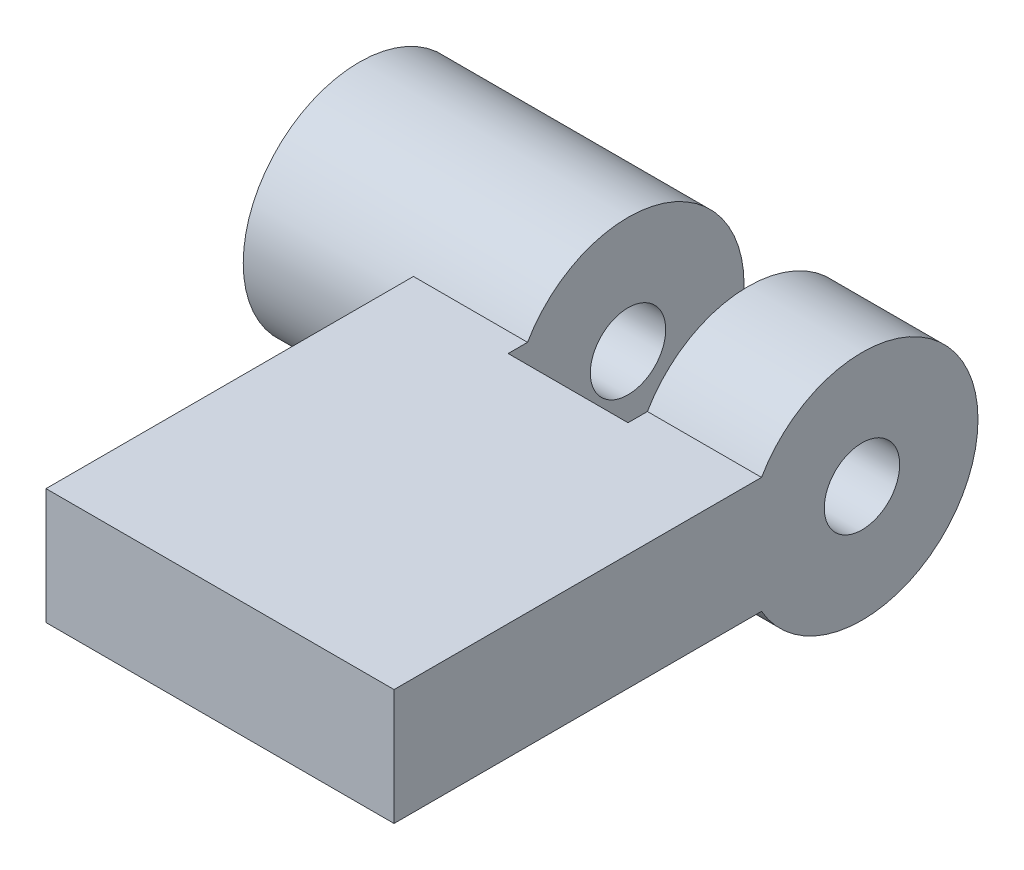
ISO-10303-21;
HEADER;
FILE_DESCRIPTION(('STEP AP214'),'2;1');
FILE_NAME('part.step','',(''),(''),'','','');
FILE_SCHEMA(('AUTOMOTIVE_DESIGN { 1 0 10303 214 1 1 1 1 }'));
ENDSEC;
DATA;
#1=APPLICATION_CONTEXT('core data for automotive mechanical design processes');
#2=APPLICATION_PROTOCOL_DEFINITION('international standard','automotive_design',2000,#1);
#3=PRODUCT_CONTEXT('',#1,'mechanical');
#4=PRODUCT('Part','Part','',(#3));
#5=PRODUCT_RELATED_PRODUCT_CATEGORY('part','',(#4));
#6=PRODUCT_DEFINITION_FORMATION('','',#4);
#7=PRODUCT_DEFINITION_CONTEXT('part definition',#1,'design');
#8=PRODUCT_DEFINITION('design','',#6,#7);
#9=PRODUCT_DEFINITION_SHAPE('','',#8);
#10=(LENGTH_UNIT() NAMED_UNIT(*) SI_UNIT(.MILLI.,.METRE.));
#11=(NAMED_UNIT(*) PLANE_ANGLE_UNIT() SI_UNIT($,.RADIAN.));
#12=(NAMED_UNIT(*) SI_UNIT($,.STERADIAN.) SOLID_ANGLE_UNIT());
#13=UNCERTAINTY_MEASURE_WITH_UNIT(LENGTH_MEASURE(1.E-05),#10,'distance_accuracy_value','');
#14=(GEOMETRIC_REPRESENTATION_CONTEXT(3) GLOBAL_UNCERTAINTY_ASSIGNED_CONTEXT((#13)) GLOBAL_UNIT_ASSIGNED_CONTEXT((#10,
#11,#12)) REPRESENTATION_CONTEXT('',''));
#15=CARTESIAN_POINT('',(0.,0.,0.));
#16=DIRECTION('',(0.,0.,1.));
#17=DIRECTION('',(1.,0.,0.));
#18=AXIS2_PLACEMENT_3D('',#15,#16,#17);
#19=CARTESIAN_POINT('',(0.,3.,-9.));
#20=DIRECTION('',(0.,0.,1.));
#21=DIRECTION('',(1.,0.,0.));
#22=AXIS2_PLACEMENT_3D('',#19,#20,#21);
#23=PLANE('',#22);
#24=DIRECTION('',(0.,-1.,0.));
#25=VECTOR('',#24,1.);
#26=CARTESIAN_POINT('',(2.95,4.5,-9.));
#27=LINE('',#26,#25);
#28=CARTESIAN_POINT('',(2.95000000000001,3.,-9.));
#29=VERTEX_POINT('',#28);
#30=CARTESIAN_POINT('',(2.95000000000001,0.,-9.));
#31=VERTEX_POINT('',#30);
#32=EDGE_CURVE('E360',#29,#31,#27,.T.);
#33=ORIENTED_EDGE('',*,*,#32,.F.);
#34=DIRECTION('',(-1.,0.,0.));
#35=VECTOR('',#34,1.);
#36=CARTESIAN_POINT('',(0.,3.,-9.));
#37=LINE('',#36,#35);
#38=CARTESIAN_POINT('',(6.05,3.,-9.));
#39=VERTEX_POINT('',#38);
#40=EDGE_CURVE('E378',#39,#29,#37,.T.);
#41=ORIENTED_EDGE('',*,*,#40,.F.);
#42=DIRECTION('',(0.,1.,0.));
#43=VECTOR('',#42,1.);
#44=CARTESIAN_POINT('',(6.05,4.5,-9.));
#45=LINE('',#44,#43);
#46=CARTESIAN_POINT('',(6.05,0.,-9.));
#47=VERTEX_POINT('',#46);
#48=EDGE_CURVE('E365',#47,#39,#45,.T.);
#49=ORIENTED_EDGE('',*,*,#48,.F.);
#50=DIRECTION('',(-1.,0.,0.));
#51=VECTOR('',#50,1.);
#52=CARTESIAN_POINT('',(0.,0.,-9.));
#53=LINE('',#52,#51);
#54=EDGE_CURVE('E374',#47,#31,#53,.T.);
#55=ORIENTED_EDGE('',*,*,#54,.T.);
#56=EDGE_LOOP('',(#33,#41,#49,#55));
#57=FACE_BOUND('',#56,.T.);
#58=ADVANCED_FACE('F40',(#57),#23,.F.);
#59=CARTESIAN_POINT('',(0.,3.,0.));
#60=DIRECTION('',(1.,0.,0.));
#61=DIRECTION('',(0.,0.,-1.));
#62=AXIS2_PLACEMENT_3D('',#59,#60,#61);
#63=PLANE('',#62);
#64=CARTESIAN_POINT('',(0.,1.5,-12.1));
#65=DIRECTION('',(-1.,0.,0.));
#66=DIRECTION('',(0.,0.,1.));
#67=AXIS2_PLACEMENT_3D('',#64,#65,#66);
#68=CIRCLE('',#67,3.);
#69=CARTESIAN_POINT('',(0.,0.,-9.50192378864669));
#70=VERTEX_POINT('',#69);
#71=CARTESIAN_POINT('',(0.,3.,-9.50192378864669));
#72=VERTEX_POINT('',#71);
#73=EDGE_CURVE('E53',#70,#72,#68,.T.);
#74=ORIENTED_EDGE('',*,*,#73,.F.);
#75=DIRECTION('',(0.,0.,1.));
#76=VECTOR('',#75,1.);
#77=CARTESIAN_POINT('',(0.,0.,0.));
#78=LINE('',#77,#76);
#79=CARTESIAN_POINT('',(0.,0.,0.));
#80=VERTEX_POINT('',#79);
#81=EDGE_CURVE('E363',#70,#80,#78,.T.);
#82=ORIENTED_EDGE('',*,*,#81,.T.);
#83=DIRECTION('',(0.,-1.,0.));
#84=VECTOR('',#83,1.);
#85=CARTESIAN_POINT('',(0.,3.,0.));
#86=LINE('',#85,#84);
#87=CARTESIAN_POINT('',(0.,3.,0.));
#88=VERTEX_POINT('',#87);
#89=EDGE_CURVE('E369',#88,#80,#86,.T.);
#90=ORIENTED_EDGE('',*,*,#89,.F.);
#91=DIRECTION('',(0.,0.,1.));
#92=VECTOR('',#91,1.);
#93=CARTESIAN_POINT('',(0.,3.,0.));
#94=LINE('',#93,#92);
#95=EDGE_CURVE('E370',#72,#88,#94,.T.);
#96=ORIENTED_EDGE('',*,*,#95,.F.);
#97=EDGE_LOOP('',(#74,#82,#90,#96));
#98=FACE_BOUND('',#97,.T.);
#99=ADVANCED_FACE('F439',(#98),#63,.F.);
#100=CARTESIAN_POINT('',(0.,3.,0.));
#101=DIRECTION('',(0.,0.,-1.));
#102=DIRECTION('',(-1.,0.,0.));
#103=AXIS2_PLACEMENT_3D('',#100,#101,#102);
#104=PLANE('',#103);
#105=DIRECTION('',(1.,0.,0.));
#106=VECTOR('',#105,1.);
#107=CARTESIAN_POINT('',(0.,0.,0.));
#108=LINE('',#107,#106);
#109=CARTESIAN_POINT('',(9.,0.,0.));
#110=VERTEX_POINT('',#109);
#111=EDGE_CURVE('E384',#80,#110,#108,.T.);
#112=ORIENTED_EDGE('',*,*,#111,.T.);
#113=DIRECTION('',(0.,-1.,0.));
#114=VECTOR('',#113,1.);
#115=CARTESIAN_POINT('',(9.,3.,0.));
#116=LINE('',#115,#114);
#117=CARTESIAN_POINT('',(9.,3.,0.));
#118=VERTEX_POINT('',#117);
#119=EDGE_CURVE('E381',#118,#110,#116,.T.);
#120=ORIENTED_EDGE('',*,*,#119,.F.);
#121=DIRECTION('',(1.,0.,0.));
#122=VECTOR('',#121,1.);
#123=CARTESIAN_POINT('',(0.,3.,0.));
#124=LINE('',#123,#122);
#125=EDGE_CURVE('E373',#88,#118,#124,.T.);
#126=ORIENTED_EDGE('',*,*,#125,.F.);
#127=ORIENTED_EDGE('',*,*,#89,.T.);
#128=EDGE_LOOP('',(#112,#120,#126,#127));
#129=FACE_BOUND('',#128,.T.);
#130=ADVANCED_FACE('F441',(#129),#104,.F.);
#131=CARTESIAN_POINT('',(9.,3.,0.));
#132=DIRECTION('',(-1.,0.,0.));
#133=DIRECTION('',(0.,0.,1.));
#134=AXIS2_PLACEMENT_3D('',#131,#132,#133);
#135=PLANE('',#134);
#136=CARTESIAN_POINT('',(9.,1.5,-12.1));
#137=DIRECTION('',(1.,0.,0.));
#138=DIRECTION('',(0.,0.,-1.));
#139=AXIS2_PLACEMENT_3D('',#136,#137,#138);
#140=CIRCLE('',#139,0.975);
#141=CARTESIAN_POINT('',(9.,1.5,-13.075));
#142=VERTEX_POINT('',#141);
#143=EDGE_CURVE('E349',#142,#142,#140,.T.);
#144=ORIENTED_EDGE('',*,*,#143,.F.);
#145=EDGE_LOOP('',(#144));
#146=FACE_BOUND('',#145,.T.);
#147=CARTESIAN_POINT('',(9.,1.5,-12.1));
#148=DIRECTION('',(-1.,0.,0.));
#149=DIRECTION('',(0.,0.,1.));
#150=AXIS2_PLACEMENT_3D('',#147,#148,#149);
#151=CIRCLE('',#150,3.);
#152=CARTESIAN_POINT('',(9.,1.5,-15.1));
#153=VERTEX_POINT('',#152);
#154=CARTESIAN_POINT('',(9.,3.,-9.50192378864669));
#155=VERTEX_POINT('',#154);
#156=EDGE_CURVE('E401',#153,#155,#151,.F.);
#157=ORIENTED_EDGE('',*,*,#156,.T.);
#158=DIRECTION('',(0.,0.,-1.));
#159=VECTOR('',#158,1.);
#160=CARTESIAN_POINT('',(9.,3.,0.));
#161=LINE('',#160,#159);
#162=EDGE_CURVE('E376',#118,#155,#161,.T.);
#163=ORIENTED_EDGE('',*,*,#162,.F.);
#164=ORIENTED_EDGE('',*,*,#119,.T.);
#165=DIRECTION('',(0.,0.,-1.));
#166=VECTOR('',#165,1.);
#167=CARTESIAN_POINT('',(9.,0.,0.));
#168=LINE('',#167,#166);
#169=CARTESIAN_POINT('',(9.,0.,-9.50192378864669));
#170=VERTEX_POINT('',#169);
#171=EDGE_CURVE('E386',#110,#170,#168,.T.);
#172=ORIENTED_EDGE('',*,*,#171,.T.);
#173=CARTESIAN_POINT('',(9.,1.5,-12.1));
#174=DIRECTION('',(-1.,0.,0.));
#175=DIRECTION('',(0.,0.,1.));
#176=AXIS2_PLACEMENT_3D('',#173,#174,#175);
#177=CIRCLE('',#176,3.);
#178=EDGE_CURVE('E68',#170,#153,#177,.F.);
#179=ORIENTED_EDGE('',*,*,#178,.T.);
#180=EDGE_LOOP('',(#157,#163,#164,#172,#179));
#181=FACE_BOUND('',#180,.T.);
#182=ADVANCED_FACE('F444',(#146,#181),#135,.F.);
#183=CARTESIAN_POINT('',(0.,3.,0.));
#184=DIRECTION('',(0.,-1.,0.));
#185=DIRECTION('',(0.,0.,-1.));
#186=AXIS2_PLACEMENT_3D('',#183,#184,#185);
#187=PLANE('',#186);
#188=ORIENTED_EDGE('',*,*,#95,.T.);
#189=ORIENTED_EDGE('',*,*,#125,.T.);
#190=ORIENTED_EDGE('',*,*,#162,.T.);
#191=DIRECTION('',(-1.,0.,0.));
#192=VECTOR('',#191,1.);
#193=CARTESIAN_POINT('',(21.1,3.,-9.50192378864669));
#194=LINE('',#193,#192);
#195=CARTESIAN_POINT('',(6.05,3.,-9.50192378864669));
#196=VERTEX_POINT('',#195);
#197=EDGE_CURVE('E337',#155,#196,#194,.T.);
#198=ORIENTED_EDGE('',*,*,#197,.T.);
#199=DIRECTION('',(0.,0.,-1.));
#200=VECTOR('',#199,1.);
#201=CARTESIAN_POINT('',(6.05,3.,-15.1));
#202=LINE('',#201,#200);
#203=EDGE_CURVE('E346',#39,#196,#202,.T.);
#204=ORIENTED_EDGE('',*,*,#203,.F.);
#205=ORIENTED_EDGE('',*,*,#40,.T.);
#206=DIRECTION('',(0.,0.,1.));
#207=VECTOR('',#206,1.);
#208=CARTESIAN_POINT('',(2.95,3.,-15.1));
#209=LINE('',#208,#207);
#210=CARTESIAN_POINT('',(2.95000000000001,3.,-9.50192378864669));
#211=VERTEX_POINT('',#210);
#212=EDGE_CURVE('E334',#211,#29,#209,.T.);
#213=ORIENTED_EDGE('',*,*,#212,.F.);
#214=EDGE_CURVE('E335',#211,#72,#194,.T.);
#215=ORIENTED_EDGE('',*,*,#214,.T.);
#216=EDGE_LOOP('',(#188,#189,#190,#198,#204,#205,#213,#215));
#217=FACE_BOUND('',#216,.T.);
#218=ADVANCED_FACE('F419',(#217),#187,.F.);
#219=CARTESIAN_POINT('',(0.,0.,0.));
#220=DIRECTION('',(0.,-1.,0.));
#221=DIRECTION('',(0.,0.,-1.));
#222=AXIS2_PLACEMENT_3D('',#219,#220,#221);
#223=PLANE('',#222);
#224=ORIENTED_EDGE('',*,*,#81,.F.);
#225=DIRECTION('',(-1.,0.,0.));
#226=VECTOR('',#225,1.);
#227=CARTESIAN_POINT('',(21.1,0.,-9.50192378864669));
#228=LINE('',#227,#226);
#229=CARTESIAN_POINT('',(2.95000000000001,0.,-9.50192378864669));
#230=VERTEX_POINT('',#229);
#231=EDGE_CURVE('E331',#230,#70,#228,.T.);
#232=ORIENTED_EDGE('',*,*,#231,.F.);
#233=DIRECTION('',(0.,0.,-1.));
#234=VECTOR('',#233,1.);
#235=CARTESIAN_POINT('',(2.95,0.,-15.1));
#236=LINE('',#235,#234);
#237=EDGE_CURVE('E341',#31,#230,#236,.T.);
#238=ORIENTED_EDGE('',*,*,#237,.F.);
#239=ORIENTED_EDGE('',*,*,#54,.F.);
#240=DIRECTION('',(0.,0.,1.));
#241=VECTOR('',#240,1.);
#242=CARTESIAN_POINT('',(6.05,0.,-15.1));
#243=LINE('',#242,#241);
#244=CARTESIAN_POINT('',(6.05,0.,-9.50192378864669));
#245=VERTEX_POINT('',#244);
#246=EDGE_CURVE('E344',#245,#47,#243,.T.);
#247=ORIENTED_EDGE('',*,*,#246,.F.);
#248=EDGE_CURVE('E338',#170,#245,#228,.T.);
#249=ORIENTED_EDGE('',*,*,#248,.F.);
#250=ORIENTED_EDGE('',*,*,#171,.F.);
#251=ORIENTED_EDGE('',*,*,#111,.F.);
#252=EDGE_LOOP('',(#224,#232,#238,#239,#247,#249,#250,#251));
#253=FACE_BOUND('',#252,.T.);
#254=ADVANCED_FACE('F428',(#253),#223,.T.);
#255=CARTESIAN_POINT('',(6.05,4.5,-15.1));
#256=DIRECTION('',(1.,0.,0.));
#257=DIRECTION('',(0.,1.,0.));
#258=AXIS2_PLACEMENT_3D('',#255,#256,#257);
#259=PLANE('',#258);
#260=CARTESIAN_POINT('',(6.05,1.5,-12.1));
#261=DIRECTION('',(1.,0.,0.));
#262=DIRECTION('',(0.,1.,0.));
#263=AXIS2_PLACEMENT_3D('',#260,#261,#262);
#264=CIRCLE('',#263,0.975);
#265=CARTESIAN_POINT('',(6.05,2.475,-12.1));
#266=VERTEX_POINT('',#265);
#267=EDGE_CURVE('E353',#266,#266,#264,.T.);
#268=ORIENTED_EDGE('',*,*,#267,.T.);
#269=EDGE_LOOP('',(#268));
#270=FACE_BOUND('',#269,.T.);
#271=ORIENTED_EDGE('',*,*,#203,.T.);
#272=CARTESIAN_POINT('',(6.05,1.5,-12.1));
#273=DIRECTION('',(1.,0.,0.));
#274=DIRECTION('',(0.,1.,0.));
#275=AXIS2_PLACEMENT_3D('',#272,#273,#274);
#276=CIRCLE('',#275,3.);
#277=CARTESIAN_POINT('',(6.05,1.5,-15.1));
#278=VERTEX_POINT('',#277);
#279=EDGE_CURVE('E397',#196,#278,#276,.F.);
#280=ORIENTED_EDGE('',*,*,#279,.T.);
#281=CARTESIAN_POINT('',(6.05,1.5,-12.1));
#282=DIRECTION('',(1.,0.,0.));
#283=DIRECTION('',(0.,1.,0.));
#284=AXIS2_PLACEMENT_3D('',#281,#282,#283);
#285=CIRCLE('',#284,3.);
#286=EDGE_CURVE('E399',#278,#245,#285,.F.);
#287=ORIENTED_EDGE('',*,*,#286,.T.);
#288=ORIENTED_EDGE('',*,*,#246,.T.);
#289=ORIENTED_EDGE('',*,*,#48,.T.);
#290=EDGE_LOOP('',(#271,#280,#287,#288,#289));
#291=FACE_BOUND('',#290,.T.);
#292=ADVANCED_FACE('F423',(#270,#291),#259,.F.);
#293=CARTESIAN_POINT('',(2.95,4.5,-15.1));
#294=DIRECTION('',(-1.,0.,0.));
#295=DIRECTION('',(0.,-1.,0.));
#296=AXIS2_PLACEMENT_3D('',#293,#294,#295);
#297=PLANE('',#296);
#298=CARTESIAN_POINT('',(2.95,1.5,-12.1));
#299=DIRECTION('',(-1.,0.,0.));
#300=DIRECTION('',(0.,-1.,0.));
#301=AXIS2_PLACEMENT_3D('',#298,#299,#300);
#302=CIRCLE('',#301,0.975);
#303=CARTESIAN_POINT('',(2.95,0.525,-12.1));
#304=VERTEX_POINT('',#303);
#305=EDGE_CURVE('E352',#304,#304,#302,.T.);
#306=ORIENTED_EDGE('',*,*,#305,.T.);
#307=EDGE_LOOP('',(#306));
#308=FACE_BOUND('',#307,.T.);
#309=CARTESIAN_POINT('',(2.95,1.5,-12.1));
#310=DIRECTION('',(-1.,0.,0.));
#311=DIRECTION('',(0.,-1.,0.));
#312=AXIS2_PLACEMENT_3D('',#309,#310,#311);
#313=CIRCLE('',#312,3.);
#314=CARTESIAN_POINT('',(2.95,1.5,-15.1));
#315=VERTEX_POINT('',#314);
#316=EDGE_CURVE('E395',#315,#211,#313,.F.);
#317=ORIENTED_EDGE('',*,*,#316,.T.);
#318=ORIENTED_EDGE('',*,*,#212,.T.);
#319=ORIENTED_EDGE('',*,*,#32,.T.);
#320=ORIENTED_EDGE('',*,*,#237,.T.);
#321=CARTESIAN_POINT('',(2.95,1.5,-12.1));
#322=DIRECTION('',(-1.,0.,0.));
#323=DIRECTION('',(0.,-1.,0.));
#324=AXIS2_PLACEMENT_3D('',#321,#322,#323);
#325=CIRCLE('',#324,3.);
#326=EDGE_CURVE('E368',#230,#315,#325,.F.);
#327=ORIENTED_EDGE('',*,*,#326,.T.);
#328=EDGE_LOOP('',(#317,#318,#319,#320,#327));
#329=FACE_BOUND('',#328,.T.);
#330=ADVANCED_FACE('F411',(#308,#329),#297,.F.);
#331=CARTESIAN_POINT('',(0.,1.5,-12.1));
#332=DIRECTION('',(-1.,0.,0.));
#333=DIRECTION('',(0.,0.,1.));
#334=AXIS2_PLACEMENT_3D('',#331,#332,#333);
#335=CYLINDRICAL_SURFACE('',#334,3.);
#336=CARTESIAN_POINT('',(-1.6,-1.06855990780826,-13.65));
#337=CARTESIAN_POINT('',(-1.51965965728809,-1.06856758763115,-13.6499940710925));
#338=CARTESIAN_POINT('',(-1.43922760038354,-1.07238737620073,-13.6437113592268));
#339=CARTESIAN_POINT('',(-1.28086682131012,-1.08709992521849,-13.618916716737));
#340=CARTESIAN_POINT('',(-1.20294332000217,-1.09800654738096,-13.6003808178719));
#341=CARTESIAN_POINT('',(-1.05219399390608,-1.12528412383221,-13.5521155286003));
#342=CARTESIAN_POINT('',(-0.979342268881091,-1.14162440408012,-13.5224488555685));
#343=CARTESIAN_POINT('',(-0.839670290434793,-1.17787992722966,-13.4529562844199));
#344=CARTESIAN_POINT('',(-0.772850701717504,-1.19779556339244,-13.4131292685418));
#345=CARTESIAN_POINT('',(-0.640624349047,-1.24110531727557,-13.3203219780024));
#346=CARTESIAN_POINT('',(-0.575864763544913,-1.2646513004468,-13.2664901308607));
#347=CARTESIAN_POINT('',(-0.455784596858195,-1.31134587456851,-13.1489681755742));
#348=CARTESIAN_POINT('',(-0.400469006185141,-1.33449424963512,-13.0852728889626));
#349=CARTESIAN_POINT('',(-0.296876729450554,-1.37980949206863,-12.9441420157628));
#350=CARTESIAN_POINT('',(-0.249411449594433,-1.40178054660839,-12.8660420026549));
#351=CARTESIAN_POINT('',(-0.168591056304263,-1.44026618916116,-12.7016165672821));
#352=CARTESIAN_POINT('',(-0.135226444875692,-1.45678444844663,-12.6152967299406));
#353=CARTESIAN_POINT('',(-0.0861690482767856,-1.48140398435746,-12.4437514253442));
#354=CARTESIAN_POINT('',(-0.0693369418925959,-1.49004437442711,-12.3589309380903));
#355=CARTESIAN_POINT('',(-0.0500546411554371,-1.49995965106026,-12.1872652452121));
#356=CARTESIAN_POINT('',(-0.0475950575343522,-1.50123934620302,-12.1004213986491));
#357=CARTESIAN_POINT('',(-0.0567239759540671,-1.49653017783555,-11.9358056744413));
#358=CARTESIAN_POINT('',(-0.0670312853932697,-1.49120414963753,-11.8579391363423));
#359=CARTESIAN_POINT('',(-0.0990867539450054,-1.47490343836279,-11.7052247395205));
#360=CARTESIAN_POINT('',(-0.120835774875055,-1.46392832978495,-11.6303771086463));
#361=CARTESIAN_POINT('',(-0.175257255546335,-1.43714577929528,-11.4845766075297));
#362=CARTESIAN_POINT('',(-0.208068182546189,-1.42127731120307,-11.4136870963362));
#363=CARTESIAN_POINT('',(-0.283469171468184,-1.38611193920134,-11.2782578318708));
#364=CARTESIAN_POINT('',(-0.326062640444771,-1.36681384135456,-11.213720302074));
#365=CARTESIAN_POINT('',(-0.424655897335561,-1.32431625347965,-11.0859959232834));
#366=CARTESIAN_POINT('',(-0.481566026303356,-1.30091965725316,-11.0235769575802));
#367=CARTESIAN_POINT('',(-0.604760726187237,-1.25404340345798,-10.9087402129542));
#368=CARTESIAN_POINT('',(-0.671053270710346,-1.23056369197504,-10.8563310307434));
#369=CARTESIAN_POINT('',(-0.816872900030617,-1.18433935057199,-10.7593240145814));
#370=CARTESIAN_POINT('',(-0.897006003692227,-1.16176585737562,-10.7155471720931));
#371=CARTESIAN_POINT('',(-1.06491467871007,-1.12244082990642,-10.6424184072933));
#372=CARTESIAN_POINT('',(-1.15268175705477,-1.10568292666568,-10.6130506900827));
#373=CARTESIAN_POINT('',(-1.32597130042746,-1.08182970365164,-10.5720338590925));
#374=CARTESIAN_POINT('',(-1.41110482983895,-1.07406462933597,-10.5591477529313));
#375=CARTESIAN_POINT('',(-1.58264893655223,-1.06719372521464,-10.5477207408006));
#376=CARTESIAN_POINT('',(-1.66905840040839,-1.06808074500257,-10.5491679892389));
#377=CARTESIAN_POINT('',(-1.82955739997075,-1.07770145969976,-10.5652313202232));
#378=CARTESIAN_POINT('',(-1.90387569364275,-1.08547570331481,-10.5782377876755));
#379=CARTESIAN_POINT('',(-2.04911281751408,-1.10653659420376,-10.6146027047755));
#380=CARTESIAN_POINT('',(-2.1200304333197,-1.11982519455895,-10.6379648223996));
#381=CARTESIAN_POINT('',(-2.26015926432493,-1.15111755303424,-10.6954755515028));
#382=CARTESIAN_POINT('',(-2.32914488004135,-1.16930882951019,-10.7300677921737));
#383=CARTESIAN_POINT('',(-2.46073849690178,-1.2082118952703,-10.8086785833002));
#384=CARTESIAN_POINT('',(-2.52334319050509,-1.22892497964523,-10.8527019860802));
#385=CARTESIAN_POINT('',(-2.64933755445242,-1.27392991563014,-10.9559305757688));
#386=CARTESIAN_POINT('',(-2.71166980213895,-1.29832457859212,-11.0163874529063));
#387=CARTESIAN_POINT('',(-2.82566644947866,-1.34553409763735,-11.1472286815279));
#388=CARTESIAN_POINT('',(-2.87732644041446,-1.36834829825402,-11.2176171156183));
#389=CARTESIAN_POINT('',(-2.97003557671578,-1.41079728556098,-11.369471711076));
#390=CARTESIAN_POINT('',(-3.01067105009539,-1.43029988061538,-11.4512300883019));
#391=CARTESIAN_POINT('',(-3.07719291118519,-1.46289604969122,-11.6217198787634));
#392=CARTESIAN_POINT('',(-3.10309308647156,-1.47599561330176,-11.7104446848513));
#393=CARTESIAN_POINT('',(-3.13704178698828,-1.49329389211888,-11.8832080174335));
#394=CARTESIAN_POINT('',(-3.14655873050525,-1.49822306876511,-11.9668850795089));
#395=CARTESIAN_POINT('',(-3.15188117934839,-1.50097103355683,-12.1347780939832));
#396=CARTESIAN_POINT('',(-3.14769218727201,-1.49879267520451,-12.2189938165733));
#397=CARTESIAN_POINT('',(-3.12665282770562,-1.48799243472545,-12.3790501839634));
#398=CARTESIAN_POINT('',(-3.11075307818521,-1.47985458335338,-12.4550522305319));
#399=CARTESIAN_POINT('',(-3.06808270088817,-1.45845010729966,-12.6031653421649));
#400=CARTESIAN_POINT('',(-3.0413106096103,-1.44518279216408,-12.6752758819215));
#401=CARTESIAN_POINT('',(-2.9765569832484,-1.41403017134419,-12.8168665475462));
#402=CARTESIAN_POINT('',(-2.93816479677141,-1.39597937073075,-12.8861213167482));
#403=CARTESIAN_POINT('',(-2.85176814439742,-1.35708525970917,-13.0174770414761));
#404=CARTESIAN_POINT('',(-2.8037593559966,-1.33624069494933,-13.0795747601811));
#405=CARTESIAN_POINT('',(-2.69366131657442,-1.29120242805909,-13.2017531344783));
#406=CARTESIAN_POINT('',(-2.63062232455188,-1.26688703009447,-13.2609351466066));
#407=CARTESIAN_POINT('',(-2.49526643875769,-1.21937285599714,-13.3682524701597));
#408=CARTESIAN_POINT('',(-2.42294045843154,-1.1961752044712,-13.416376832209));
#409=CARTESIAN_POINT('',(-2.26712632734687,-1.15268352260283,-13.5020261139671));
#410=CARTESIAN_POINT('',(-2.18329546524746,-1.1325537877284,-13.539016674449));
#411=CARTESIAN_POINT('',(-2.0092567506496,-1.09957382501018,-13.5977911929329));
#412=CARTESIAN_POINT('',(-1.91907117884379,-1.0866994604253,-13.6196256283028));
#413=CARTESIAN_POINT('',(-1.7898338271038,-1.07528987108191,-13.6388026726232));
#414=CARTESIAN_POINT('',(-1.75204121336429,-1.07277665675291,-13.642994090114));
#415=CARTESIAN_POINT('',(-1.67617261904999,-1.06940980204655,-13.6485942470779));
#416=CARTESIAN_POINT('',(-1.63809662079364,-1.06855626610983,-13.6500028114312));
#417=CARTESIAN_POINT('',(-1.6,-1.06855990780826,-13.65));
#418=B_SPLINE_CURVE_WITH_KNOTS('',3,(#336,#337,#338,#339,#340,#341,#342,#343,#344,#345,#346,
#347,#348,#349,#350,#351,#352,#353,#354,#355,#356,#357,#358,#359,#360,#361,#362,#363,#364,#365,
#366,#367,#368,#369,#370,#371,#372,#373,#374,#375,#376,#377,#378,#379,#380,#381,#382,#383,#384,
#385,#386,#387,#388,#389,#390,#391,#392,#393,#394,#395,#396,#397,#398,#399,#400,#401,#402,#403,
#404,#405,#406,#407,#408,#409,#410,#411,#412,#413,#414,#415,#416,#417),.UNSPECIFIED.,.T.,.F.,(4,
2,2,2,2,2,2,2,2,2,2,2,2,2,2,2,2,2,2,2,2,2,2,2,2,2,2,2,2,2,2,2,2,2,2,2,2,2,2,2,4),(0.,
0.240860404934379,0.48219335230399,0.722186424528837,0.96220591030352,1.2234452790249,
1.48482227062786,1.76532798576229,2.04564445422735,2.30490154317004,2.56398924593493,
2.7990581657298,3.03414479402262,3.27229068379531,3.51051964090497,3.7723607934912,
4.03442582200953,4.31513509274971,4.59553596615625,4.85334395290183,5.11093889578024,
5.33746018243238,5.56406176722676,5.80100537313768,6.03807118035938,6.30746891746102,
6.57697772141108,6.8555195369389,7.13380029500913,7.38550951502228,7.63711769235047,
7.87028238079253,8.1034784654127,8.34613400201953,8.58889885402428,8.85718985782794,
9.12574539156813,9.40565889084488,9.68463560847094,9.79884211828697,9.91305581468469),.UNSPECIFIED.);
#419=CARTESIAN_POINT('',(-1.6,-1.06855990780826,-13.65));
#420=VERTEX_POINT('',#419);
#421=EDGE_CURVE('E11',#420,#420,#418,.T.);
#422=ORIENTED_EDGE('',*,*,#421,.F.);
#423=EDGE_LOOP('',(#422));
#424=FACE_BOUND('',#423,.T.);
#425=ORIENTED_EDGE('',*,*,#326,.F.);
#426=ORIENTED_EDGE('',*,*,#231,.T.);
#427=ORIENTED_EDGE('',*,*,#73,.T.);
#428=ORIENTED_EDGE('',*,*,#214,.F.);
#429=ORIENTED_EDGE('',*,*,#316,.F.);
#430=DIRECTION('',(-1.,0.,0.));
#431=VECTOR('',#430,1.);
#432=CARTESIAN_POINT('',(0.,1.5,-15.1));
#433=LINE('',#432,#431);
#434=CARTESIAN_POINT('',(0.,1.5,-15.1));
#435=VERTEX_POINT('',#434);
#436=EDGE_CURVE('E364',#315,#435,#433,.T.);
#437=ORIENTED_EDGE('',*,*,#436,.T.);
#438=ORIENTED_EDGE('',*,*,#436,.F.);
#439=EDGE_LOOP('',(#425,#426,#427,#428,#429,#437,#438));
#440=FACE_BOUND('',#439,.T.);
#441=CARTESIAN_POINT('',(-4.,1.5,-12.1));
#442=DIRECTION('',(-1.,0.,0.));
#443=DIRECTION('',(0.,0.,1.));
#444=AXIS2_PLACEMENT_3D('',#441,#442,#443);
#445=CIRCLE('',#444,3.);
#446=CARTESIAN_POINT('',(-4.,1.5,-9.1));
#447=VERTEX_POINT('',#446);
#448=EDGE_CURVE('E328',#447,#447,#445,.T.);
#449=ORIENTED_EDGE('',*,*,#448,.F.);
#450=EDGE_LOOP('',(#449));
#451=FACE_BOUND('',#450,.T.);
#452=ADVANCED_FACE('F434',(#424,#440,#451),#335,.T.);
#453=CARTESIAN_POINT('',(0.,1.5,-12.1));
#454=DIRECTION('',(-1.,0.,0.));
#455=DIRECTION('',(0.,0.,1.));
#456=AXIS2_PLACEMENT_3D('',#453,#454,#455);
#457=CYLINDRICAL_SURFACE('',#456,3.);
#458=ORIENTED_EDGE('',*,*,#279,.F.);
#459=ORIENTED_EDGE('',*,*,#197,.F.);
#460=ORIENTED_EDGE('',*,*,#156,.F.);
#461=DIRECTION('',(1.,0.,0.));
#462=VECTOR('',#461,1.);
#463=CARTESIAN_POINT('',(9.,1.5,-15.1));
#464=LINE('',#463,#462);
#465=EDGE_CURVE('E359',#278,#153,#464,.T.);
#466=ORIENTED_EDGE('',*,*,#465,.F.);
#467=EDGE_LOOP('',(#458,#459,#460,#466));
#468=FACE_BOUND('',#467,.T.);
#469=ADVANCED_FACE('F42',(#468),#457,.T.);
#470=CARTESIAN_POINT('',(0.,1.5,-12.1));
#471=DIRECTION('',(1.,0.,0.));
#472=DIRECTION('',(0.,0.,-1.));
#473=AXIS2_PLACEMENT_3D('',#470,#471,#472);
#474=CYLINDRICAL_SURFACE('',#473,3.);
#475=ORIENTED_EDGE('',*,*,#178,.F.);
#476=ORIENTED_EDGE('',*,*,#248,.T.);
#477=ORIENTED_EDGE('',*,*,#286,.F.);
#478=ORIENTED_EDGE('',*,*,#465,.T.);
#479=EDGE_LOOP('',(#475,#476,#477,#478));
#480=FACE_BOUND('',#479,.T.);
#481=ADVANCED_FACE('F448',(#480),#474,.T.);
#482=CARTESIAN_POINT('',(-2.1,1.5,-12.1));
#483=DIRECTION('',(1.,0.,0.));
#484=DIRECTION('',(0.,0.,-1.));
#485=AXIS2_PLACEMENT_3D('',#482,#483,#484);
#486=CYLINDRICAL_SURFACE('',#485,0.975);
#487=ORIENTED_EDGE('',*,*,#305,.F.);
#488=EDGE_LOOP('',(#487));
#489=FACE_BOUND('',#488,.T.);
#490=CARTESIAN_POINT('',(0.,1.5,-12.1));
#491=DIRECTION('',(1.,0.,0.));
#492=DIRECTION('',(0.,0.,-1.));
#493=AXIS2_PLACEMENT_3D('',#490,#491,#492);
#494=CIRCLE('',#493,0.975);
#495=CARTESIAN_POINT('',(0.,1.5,-13.075));
#496=VERTEX_POINT('',#495);
#497=EDGE_CURVE('E356',#496,#496,#494,.T.);
#498=ORIENTED_EDGE('',*,*,#497,.F.);
#499=EDGE_LOOP('',(#498));
#500=FACE_BOUND('',#499,.T.);
#501=ADVANCED_FACE('F451',(#489,#500),#486,.F.);
#502=ORIENTED_EDGE('',*,*,#143,.T.);
#503=EDGE_LOOP('',(#502));
#504=FACE_BOUND('',#503,.T.);
#505=ORIENTED_EDGE('',*,*,#267,.F.);
#506=EDGE_LOOP('',(#505));
#507=FACE_BOUND('',#506,.T.);
#508=ADVANCED_FACE('F457',(#504,#507),#486,.F.);
#509=CARTESIAN_POINT('',(-4.,1.5,-12.1));
#510=DIRECTION('',(-1.,0.,0.));
#511=DIRECTION('',(0.,0.,1.));
#512=AXIS2_PLACEMENT_3D('',#509,#510,#511);
#513=PLANE('',#512);
#514=DIRECTION('',(0.,1.,0.));
#515=VECTOR('',#514,1.);
#516=CARTESIAN_POINT('',(-4.,1.5,-11.85));
#517=LINE('',#516,#515);
#518=CARTESIAN_POINT('',(-4.,-0.8,-11.85));
#519=VERTEX_POINT('',#518);
#520=CARTESIAN_POINT('',(-4.,3.8,-11.85));
#521=VERTEX_POINT('',#520);
#522=EDGE_CURVE('E211',#519,#521,#517,.T.);
#523=ORIENTED_EDGE('',*,*,#522,.F.);
#524=CARTESIAN_POINT('',(-4.,-0.8,-12.1));
#525=DIRECTION('',(-1.,0.,0.));
#526=DIRECTION('',(0.,0.,1.));
#527=AXIS2_PLACEMENT_3D('',#524,#525,#526);
#528=CIRCLE('',#527,0.25);
#529=CARTESIAN_POINT('',(-4.,-0.8,-12.35));
#530=VERTEX_POINT('',#529);
#531=EDGE_CURVE('E229',#530,#519,#528,.T.);
#532=ORIENTED_EDGE('',*,*,#531,.F.);
#533=DIRECTION('',(0.,-1.,0.));
#534=VECTOR('',#533,1.);
#535=CARTESIAN_POINT('',(-4.,0.896446609406727,-12.35));
#536=LINE('',#535,#534);
#537=CARTESIAN_POINT('',(-4.,0.896446609406727,-12.35));
#538=VERTEX_POINT('',#537);
#539=EDGE_CURVE('E295',#538,#530,#536,.T.);
#540=ORIENTED_EDGE('',*,*,#539,.F.);
#541=DIRECTION('',(0.,0.707106781186547,0.707106781186548));
#542=VECTOR('',#541,1.);
#543=CARTESIAN_POINT('',(-4.,0.896446609406727,-12.35));
#544=LINE('',#543,#542);
#545=CARTESIAN_POINT('',(-4.,-0.303122292025696,-13.5495689014324));
#546=VERTEX_POINT('',#545);
#547=EDGE_CURVE('E292',#546,#538,#544,.T.);
#548=ORIENTED_EDGE('',*,*,#547,.F.);
#549=CARTESIAN_POINT('',(-4.,-0.12634559672906,-13.7263455967291));
#550=DIRECTION('',(-1.,0.,0.));
#551=DIRECTION('',(0.,0.,1.));
#552=AXIS2_PLACEMENT_3D('',#549,#550,#551);
#553=CIRCLE('',#552,0.249999999999998);
#554=CARTESIAN_POINT('',(-4.,0.0504310985675767,-13.9031222920257));
#555=VERTEX_POINT('',#554);
#556=EDGE_CURVE('E289',#555,#546,#553,.T.);
#557=ORIENTED_EDGE('',*,*,#556,.F.);
#558=DIRECTION('',(0.,-0.707106781186548,-0.707106781186547));
#559=VECTOR('',#558,1.);
#560=CARTESIAN_POINT('',(-4.,1.25,-12.7035533905933));
#561=LINE('',#560,#559);
#562=CARTESIAN_POINT('',(-4.,1.25,-12.7035533905933));
#563=VERTEX_POINT('',#562);
#564=EDGE_CURVE('E286',#563,#555,#561,.T.);
#565=ORIENTED_EDGE('',*,*,#564,.F.);
#566=DIRECTION('',(0.,0.,1.));
#567=VECTOR('',#566,1.);
#568=CARTESIAN_POINT('',(-4.,1.25,-12.7035533905933));
#569=LINE('',#568,#567);
#570=CARTESIAN_POINT('',(-4.,1.25,-14.4));
#571=VERTEX_POINT('',#570);
#572=EDGE_CURVE('E283',#571,#563,#569,.T.);
#573=ORIENTED_EDGE('',*,*,#572,.F.);
#574=CARTESIAN_POINT('',(-4.,1.5,-14.4));
#575=DIRECTION('',(-1.,0.,0.));
#576=DIRECTION('',(0.,0.,1.));
#577=AXIS2_PLACEMENT_3D('',#574,#575,#576);
#578=CIRCLE('',#577,0.25);
#579=CARTESIAN_POINT('',(-4.,1.75,-14.4));
#580=VERTEX_POINT('',#579);
#581=EDGE_CURVE('E280',#580,#571,#578,.T.);
#582=ORIENTED_EDGE('',*,*,#581,.F.);
#583=DIRECTION('',(0.,0.,-1.));
#584=VECTOR('',#583,1.);
#585=CARTESIAN_POINT('',(-4.,1.75,-12.7035533905933));
#586=LINE('',#585,#584);
#587=CARTESIAN_POINT('',(-4.,1.75,-12.7035533905933));
#588=VERTEX_POINT('',#587);
#589=EDGE_CURVE('E277',#588,#580,#586,.T.);
#590=ORIENTED_EDGE('',*,*,#589,.F.);
#591=DIRECTION('',(0.,-0.707106781186547,0.707106781186548));
#592=VECTOR('',#591,1.);
#593=CARTESIAN_POINT('',(-4.,1.75,-12.7035533905933));
#594=LINE('',#593,#592);
#595=CARTESIAN_POINT('',(-4.,2.94956890143242,-13.9031222920257));
#596=VERTEX_POINT('',#595);
#597=EDGE_CURVE('E274',#596,#588,#594,.T.);
#598=ORIENTED_EDGE('',*,*,#597,.F.);
#599=CARTESIAN_POINT('',(-4.,3.12634559672906,-13.7263455967291));
#600=DIRECTION('',(-1.,0.,0.));
#601=DIRECTION('',(0.,0.,1.));
#602=AXIS2_PLACEMENT_3D('',#599,#600,#601);
#603=CIRCLE('',#602,0.25);
#604=CARTESIAN_POINT('',(-4.,3.30312229202569,-13.5495689014324));
#605=VERTEX_POINT('',#604);
#606=EDGE_CURVE('E271',#605,#596,#603,.T.);
#607=ORIENTED_EDGE('',*,*,#606,.F.);
#608=DIRECTION('',(0.,0.707106781186548,-0.707106781186547));
#609=VECTOR('',#608,1.);
#610=CARTESIAN_POINT('',(-4.,2.10355339059327,-12.35));
#611=LINE('',#610,#609);
#612=CARTESIAN_POINT('',(-4.,2.10355339059327,-12.35));
#613=VERTEX_POINT('',#612);
#614=EDGE_CURVE('E268',#613,#605,#611,.T.);
#615=ORIENTED_EDGE('',*,*,#614,.F.);
#616=DIRECTION('',(0.,-1.,0.));
#617=VECTOR('',#616,1.);
#618=CARTESIAN_POINT('',(-4.,2.10355339059327,-12.35));
#619=LINE('',#618,#617);
#620=CARTESIAN_POINT('',(-4.,3.8,-12.35));
#621=VERTEX_POINT('',#620);
#622=EDGE_CURVE('E265',#621,#613,#619,.T.);
#623=ORIENTED_EDGE('',*,*,#622,.F.);
#624=CARTESIAN_POINT('',(-4.,3.8,-12.1));
#625=DIRECTION('',(-1.,0.,0.));
#626=DIRECTION('',(0.,0.,1.));
#627=AXIS2_PLACEMENT_3D('',#624,#625,#626);
#628=CIRCLE('',#627,0.249999999999999);
#629=EDGE_CURVE('E263',#521,#621,#628,.T.);
#630=ORIENTED_EDGE('',*,*,#629,.F.);
#631=EDGE_LOOP('',(#523,#532,#540,#548,#557,#565,#573,#582,#590,#598,#607,#615,#623,#630));
#632=FACE_BOUND('',#631,.T.);
#633=ORIENTED_EDGE('',*,*,#448,.T.);
#634=EDGE_LOOP('',(#633));
#635=FACE_BOUND('',#634,.T.);
#636=ADVANCED_FACE('F503',(#632,#635),#513,.T.);
#637=CARTESIAN_POINT('',(0.,1.5,-12.1));
#638=DIRECTION('',(-1.,0.,0.));
#639=DIRECTION('',(0.,0.,1.));
#640=AXIS2_PLACEMENT_3D('',#637,#638,#639);
#641=PLANE('',#640);
#642=ORIENTED_EDGE('',*,*,#497,.T.);
#643=EDGE_LOOP('',(#642));
#644=FACE_BOUND('',#643,.T.);
#645=ADVANCED_FACE('F488',(#644),#641,.F.);
#646=CARTESIAN_POINT('',(-1.6,1.5,-12.1));
#647=DIRECTION('',(0.,-1.,0.));
#648=DIRECTION('',(0.,0.,-1.));
#649=AXIS2_PLACEMENT_3D('',#646,#647,#648);
#650=CYLINDRICAL_SURFACE('',#649,1.55);
#651=ORIENTED_EDGE('',*,*,#421,.T.);
#652=EDGE_LOOP('',(#651));
#653=FACE_BOUND('',#652,.T.);
#654=CARTESIAN_POINT('',(-1.6,1.5,-12.1));
#655=DIRECTION('',(0.,-1.,0.));
#656=DIRECTION('',(0.,0.,-1.));
#657=AXIS2_PLACEMENT_3D('',#654,#655,#656);
#658=CIRCLE('',#657,1.55);
#659=CARTESIAN_POINT('',(-1.6,1.5,-13.65));
#660=VERTEX_POINT('',#659);
#661=EDGE_CURVE('E302',#660,#660,#658,.T.);
#662=ORIENTED_EDGE('',*,*,#661,.F.);
#663=EDGE_LOOP('',(#662));
#664=FACE_BOUND('',#663,.T.);
#665=ADVANCED_FACE('F485',(#653,#664),#650,.F.);
#666=CARTESIAN_POINT('',(-1.6,1.5,-12.1));
#667=DIRECTION('',(0.,-1.,0.));
#668=DIRECTION('',(0.,0.,-1.));
#669=AXIS2_PLACEMENT_3D('',#666,#667,#668);
#670=PLANE('',#669);
#671=ORIENTED_EDGE('',*,*,#661,.T.);
#672=EDGE_LOOP('',(#671));
#673=FACE_BOUND('',#672,.T.);
#674=ADVANCED_FACE('F487',(#673),#670,.T.);
#675=CARTESIAN_POINT('',(-3.5,1.5,-11.85));
#676=DIRECTION('',(0.,0.,1.));
#677=DIRECTION('',(1.,0.,0.));
#678=AXIS2_PLACEMENT_3D('',#675,#676,#677);
#679=PLANE('',#678);
#680=ORIENTED_EDGE('',*,*,#522,.T.);
#681=DIRECTION('',(-1.,0.,0.));
#682=VECTOR('',#681,1.);
#683=CARTESIAN_POINT('',(-3.5,3.8,-11.85));
#684=LINE('',#683,#682);
#685=CARTESIAN_POINT('',(-3.5,3.8,-11.85));
#686=VERTEX_POINT('',#685);
#687=EDGE_CURVE('E60',#686,#521,#684,.T.);
#688=ORIENTED_EDGE('',*,*,#687,.F.);
#689=DIRECTION('',(0.,1.,0.));
#690=VECTOR('',#689,1.);
#691=CARTESIAN_POINT('',(-3.5,1.5,-11.85));
#692=LINE('',#691,#690);
#693=CARTESIAN_POINT('',(-3.5,-0.8,-11.85));
#694=VERTEX_POINT('',#693);
#695=EDGE_CURVE('E208',#694,#686,#692,.T.);
#696=ORIENTED_EDGE('',*,*,#695,.F.);
#697=DIRECTION('',(-1.,0.,0.));
#698=VECTOR('',#697,1.);
#699=CARTESIAN_POINT('',(-3.5,-0.8,-11.85));
#700=LINE('',#699,#698);
#701=EDGE_CURVE('E300',#694,#519,#700,.T.);
#702=ORIENTED_EDGE('',*,*,#701,.T.);
#703=EDGE_LOOP('',(#680,#688,#696,#702));
#704=FACE_BOUND('',#703,.T.);
#705=ADVANCED_FACE('F206',(#704),#679,.F.);
#706=CARTESIAN_POINT('',(-3.5,-0.8,-12.1));
#707=DIRECTION('',(-1.,0.,0.));
#708=DIRECTION('',(0.,0.,1.));
#709=AXIS2_PLACEMENT_3D('',#706,#707,#708);
#710=CYLINDRICAL_SURFACE('',#709,0.25);
#711=ORIENTED_EDGE('',*,*,#531,.T.);
#712=ORIENTED_EDGE('',*,*,#701,.F.);
#713=CARTESIAN_POINT('',(-3.5,-0.8,-12.1));
#714=DIRECTION('',(-1.,0.,0.));
#715=DIRECTION('',(0.,0.,1.));
#716=AXIS2_PLACEMENT_3D('',#713,#714,#715);
#717=CIRCLE('',#716,0.25);
#718=CARTESIAN_POINT('',(-3.5,-0.8,-12.35));
#719=VERTEX_POINT('',#718);
#720=EDGE_CURVE('E214',#719,#694,#717,.T.);
#721=ORIENTED_EDGE('',*,*,#720,.F.);
#722=DIRECTION('',(-1.,0.,0.));
#723=VECTOR('',#722,1.);
#724=CARTESIAN_POINT('',(-3.5,-0.8,-12.35));
#725=LINE('',#724,#723);
#726=EDGE_CURVE('E303',#719,#530,#725,.T.);
#727=ORIENTED_EDGE('',*,*,#726,.T.);
#728=EDGE_LOOP('',(#711,#712,#721,#727));
#729=FACE_BOUND('',#728,.T.);
#730=ADVANCED_FACE('F497',(#729),#710,.F.);
#731=CARTESIAN_POINT('',(-3.5,0.896446609406727,-12.35));
#732=DIRECTION('',(0.,0.,-1.));
#733=DIRECTION('',(-1.,0.,0.));
#734=AXIS2_PLACEMENT_3D('',#731,#732,#733);
#735=PLANE('',#734);
#736=ORIENTED_EDGE('',*,*,#539,.T.);
#737=ORIENTED_EDGE('',*,*,#726,.F.);
#738=DIRECTION('',(0.,-1.,0.));
#739=VECTOR('',#738,1.);
#740=CARTESIAN_POINT('',(-3.5,0.896446609406727,-12.35));
#741=LINE('',#740,#739);
#742=CARTESIAN_POINT('',(-3.5,0.896446609406727,-12.35));
#743=VERTEX_POINT('',#742);
#744=EDGE_CURVE('E260',#743,#719,#741,.T.);
#745=ORIENTED_EDGE('',*,*,#744,.F.);
#746=DIRECTION('',(-1.,0.,0.));
#747=VECTOR('',#746,1.);
#748=CARTESIAN_POINT('',(-3.5,0.896446609406727,-12.35));
#749=LINE('',#748,#747);
#750=EDGE_CURVE('E305',#743,#538,#749,.T.);
#751=ORIENTED_EDGE('',*,*,#750,.T.);
#752=EDGE_LOOP('',(#736,#737,#745,#751));
#753=FACE_BOUND('',#752,.T.);
#754=ADVANCED_FACE('F557',(#753),#735,.F.);
#755=CARTESIAN_POINT('',(-3.5,0.896446609406727,-12.35));
#756=DIRECTION('',(0.,-0.707106781186548,0.707106781186547));
#757=DIRECTION('',(0.,-0.707106781186547,-0.707106781186548));
#758=AXIS2_PLACEMENT_3D('',#755,#756,#757);
#759=PLANE('',#758);
#760=ORIENTED_EDGE('',*,*,#547,.T.);
#761=ORIENTED_EDGE('',*,*,#750,.F.);
#762=DIRECTION('',(0.,0.707106781186547,0.707106781186548));
#763=VECTOR('',#762,1.);
#764=CARTESIAN_POINT('',(-3.5,0.896446609406727,-12.35));
#765=LINE('',#764,#763);
#766=CARTESIAN_POINT('',(-3.5,-0.303122292025696,-13.5495689014324));
#767=VERTEX_POINT('',#766);
#768=EDGE_CURVE('E257',#767,#743,#765,.T.);
#769=ORIENTED_EDGE('',*,*,#768,.F.);
#770=DIRECTION('',(-1.,0.,0.));
#771=VECTOR('',#770,1.);
#772=CARTESIAN_POINT('',(-3.5,-0.303122292025696,-13.5495689014324));
#773=LINE('',#772,#771);
#774=EDGE_CURVE('E307',#767,#546,#773,.T.);
#775=ORIENTED_EDGE('',*,*,#774,.T.);
#776=EDGE_LOOP('',(#760,#761,#769,#775));
#777=FACE_BOUND('',#776,.T.);
#778=ADVANCED_FACE('F567',(#777),#759,.F.);
#779=CARTESIAN_POINT('',(-3.5,-0.12634559672906,-13.7263455967291));
#780=DIRECTION('',(-1.,0.,0.));
#781=DIRECTION('',(0.,0.,1.));
#782=AXIS2_PLACEMENT_3D('',#779,#780,#781);
#783=CYLINDRICAL_SURFACE('',#782,0.249999999999998);
#784=ORIENTED_EDGE('',*,*,#556,.T.);
#785=ORIENTED_EDGE('',*,*,#774,.F.);
#786=CARTESIAN_POINT('',(-3.5,-0.12634559672906,-13.7263455967291));
#787=DIRECTION('',(-1.,0.,0.));
#788=DIRECTION('',(0.,0.,1.));
#789=AXIS2_PLACEMENT_3D('',#786,#787,#788);
#790=CIRCLE('',#789,0.249999999999998);
#791=CARTESIAN_POINT('',(-3.5,0.0504310985675767,-13.9031222920257));
#792=VERTEX_POINT('',#791);
#793=EDGE_CURVE('E254',#792,#767,#790,.T.);
#794=ORIENTED_EDGE('',*,*,#793,.F.);
#795=DIRECTION('',(-1.,0.,0.));
#796=VECTOR('',#795,1.);
#797=CARTESIAN_POINT('',(-3.5,0.0504310985675767,-13.9031222920257));
#798=LINE('',#797,#796);
#799=EDGE_CURVE('E309',#792,#555,#798,.T.);
#800=ORIENTED_EDGE('',*,*,#799,.T.);
#801=EDGE_LOOP('',(#784,#785,#794,#800));
#802=FACE_BOUND('',#801,.T.);
#803=ADVANCED_FACE('F577',(#802),#783,.F.);
#804=CARTESIAN_POINT('',(-3.5,1.25,-12.7035533905933));
#805=DIRECTION('',(0.,0.707106781186547,-0.707106781186548));
#806=DIRECTION('',(0.,0.707106781186548,0.707106781186547));
#807=AXIS2_PLACEMENT_3D('',#804,#805,#806);
#808=PLANE('',#807);
#809=ORIENTED_EDGE('',*,*,#564,.T.);
#810=ORIENTED_EDGE('',*,*,#799,.F.);
#811=DIRECTION('',(0.,-0.707106781186548,-0.707106781186547));
#812=VECTOR('',#811,1.);
#813=CARTESIAN_POINT('',(-3.5,1.25,-12.7035533905933));
#814=LINE('',#813,#812);
#815=CARTESIAN_POINT('',(-3.5,1.25,-12.7035533905933));
#816=VERTEX_POINT('',#815);
#817=EDGE_CURVE('E251',#816,#792,#814,.T.);
#818=ORIENTED_EDGE('',*,*,#817,.F.);
#819=DIRECTION('',(-1.,0.,0.));
#820=VECTOR('',#819,1.);
#821=CARTESIAN_POINT('',(-3.5,1.25,-12.7035533905933));
#822=LINE('',#821,#820);
#823=EDGE_CURVE('E311',#816,#563,#822,.T.);
#824=ORIENTED_EDGE('',*,*,#823,.T.);
#825=EDGE_LOOP('',(#809,#810,#818,#824));
#826=FACE_BOUND('',#825,.T.);
#827=ADVANCED_FACE('F587',(#826),#808,.F.);
#828=CARTESIAN_POINT('',(-3.5,1.25,-12.7035533905933));
#829=DIRECTION('',(0.,-1.,0.));
#830=DIRECTION('',(0.,0.,-1.));
#831=AXIS2_PLACEMENT_3D('',#828,#829,#830);
#832=PLANE('',#831);
#833=ORIENTED_EDGE('',*,*,#572,.T.);
#834=ORIENTED_EDGE('',*,*,#823,.F.);
#835=DIRECTION('',(0.,0.,1.));
#836=VECTOR('',#835,1.);
#837=CARTESIAN_POINT('',(-3.5,1.25,-12.7035533905933));
#838=LINE('',#837,#836);
#839=CARTESIAN_POINT('',(-3.5,1.25,-14.4));
#840=VERTEX_POINT('',#839);
#841=EDGE_CURVE('E248',#840,#816,#838,.T.);
#842=ORIENTED_EDGE('',*,*,#841,.F.);
#843=DIRECTION('',(-1.,0.,0.));
#844=VECTOR('',#843,1.);
#845=CARTESIAN_POINT('',(-3.5,1.25,-14.4));
#846=LINE('',#845,#844);
#847=EDGE_CURVE('E313',#840,#571,#846,.T.);
#848=ORIENTED_EDGE('',*,*,#847,.T.);
#849=EDGE_LOOP('',(#833,#834,#842,#848));
#850=FACE_BOUND('',#849,.T.);
#851=ADVANCED_FACE('F597',(#850),#832,.F.);
#852=CARTESIAN_POINT('',(-3.5,1.5,-14.4));
#853=DIRECTION('',(-1.,0.,0.));
#854=DIRECTION('',(0.,0.,1.));
#855=AXIS2_PLACEMENT_3D('',#852,#853,#854);
#856=CYLINDRICAL_SURFACE('',#855,0.25);
#857=ORIENTED_EDGE('',*,*,#581,.T.);
#858=ORIENTED_EDGE('',*,*,#847,.F.);
#859=CARTESIAN_POINT('',(-3.5,1.5,-14.4));
#860=DIRECTION('',(-1.,0.,0.));
#861=DIRECTION('',(0.,0.,1.));
#862=AXIS2_PLACEMENT_3D('',#859,#860,#861);
#863=CIRCLE('',#862,0.25);
#864=CARTESIAN_POINT('',(-3.5,1.75,-14.4));
#865=VERTEX_POINT('',#864);
#866=EDGE_CURVE('E245',#865,#840,#863,.T.);
#867=ORIENTED_EDGE('',*,*,#866,.F.);
#868=DIRECTION('',(-1.,0.,0.));
#869=VECTOR('',#868,1.);
#870=CARTESIAN_POINT('',(-3.5,1.75,-14.4));
#871=LINE('',#870,#869);
#872=EDGE_CURVE('E315',#865,#580,#871,.T.);
#873=ORIENTED_EDGE('',*,*,#872,.T.);
#874=EDGE_LOOP('',(#857,#858,#867,#873));
#875=FACE_BOUND('',#874,.T.);
#876=ADVANCED_FACE('F607',(#875),#856,.F.);
#877=CARTESIAN_POINT('',(-3.5,1.75,-12.7035533905933));
#878=DIRECTION('',(0.,1.,0.));
#879=DIRECTION('',(0.,0.,1.));
#880=AXIS2_PLACEMENT_3D('',#877,#878,#879);
#881=PLANE('',#880);
#882=ORIENTED_EDGE('',*,*,#589,.T.);
#883=ORIENTED_EDGE('',*,*,#872,.F.);
#884=DIRECTION('',(0.,0.,-1.));
#885=VECTOR('',#884,1.);
#886=CARTESIAN_POINT('',(-3.5,1.75,-12.7035533905933));
#887=LINE('',#886,#885);
#888=CARTESIAN_POINT('',(-3.5,1.75,-12.7035533905933));
#889=VERTEX_POINT('',#888);
#890=EDGE_CURVE('E242',#889,#865,#887,.T.);
#891=ORIENTED_EDGE('',*,*,#890,.F.);
#892=DIRECTION('',(-1.,0.,0.));
#893=VECTOR('',#892,1.);
#894=CARTESIAN_POINT('',(-3.5,1.75,-12.7035533905933));
#895=LINE('',#894,#893);
#896=EDGE_CURVE('E317',#889,#588,#895,.T.);
#897=ORIENTED_EDGE('',*,*,#896,.T.);
#898=EDGE_LOOP('',(#882,#883,#891,#897));
#899=FACE_BOUND('',#898,.T.);
#900=ADVANCED_FACE('F617',(#899),#881,.F.);
#901=CARTESIAN_POINT('',(-3.5,1.75,-12.7035533905933));
#902=DIRECTION('',(0.,-0.707106781186548,-0.707106781186547));
#903=DIRECTION('',(0.,0.707106781186547,-0.707106781186548));
#904=AXIS2_PLACEMENT_3D('',#901,#902,#903);
#905=PLANE('',#904);
#906=ORIENTED_EDGE('',*,*,#597,.T.);
#907=ORIENTED_EDGE('',*,*,#896,.F.);
#908=DIRECTION('',(0.,-0.707106781186547,0.707106781186548));
#909=VECTOR('',#908,1.);
#910=CARTESIAN_POINT('',(-3.5,1.75,-12.7035533905933));
#911=LINE('',#910,#909);
#912=CARTESIAN_POINT('',(-3.5,2.94956890143242,-13.9031222920257));
#913=VERTEX_POINT('',#912);
#914=EDGE_CURVE('E239',#913,#889,#911,.T.);
#915=ORIENTED_EDGE('',*,*,#914,.F.);
#916=DIRECTION('',(-1.,0.,0.));
#917=VECTOR('',#916,1.);
#918=CARTESIAN_POINT('',(-3.5,2.94956890143242,-13.9031222920257));
#919=LINE('',#918,#917);
#920=EDGE_CURVE('E319',#913,#596,#919,.T.);
#921=ORIENTED_EDGE('',*,*,#920,.T.);
#922=EDGE_LOOP('',(#906,#907,#915,#921));
#923=FACE_BOUND('',#922,.T.);
#924=ADVANCED_FACE('F627',(#923),#905,.F.);
#925=CARTESIAN_POINT('',(-3.5,3.12634559672906,-13.7263455967291));
#926=DIRECTION('',(-1.,0.,0.));
#927=DIRECTION('',(0.,0.,1.));
#928=AXIS2_PLACEMENT_3D('',#925,#926,#927);
#929=CYLINDRICAL_SURFACE('',#928,0.25);
#930=ORIENTED_EDGE('',*,*,#606,.T.);
#931=ORIENTED_EDGE('',*,*,#920,.F.);
#932=CARTESIAN_POINT('',(-3.5,3.12634559672906,-13.7263455967291));
#933=DIRECTION('',(-1.,0.,0.));
#934=DIRECTION('',(0.,0.,1.));
#935=AXIS2_PLACEMENT_3D('',#932,#933,#934);
#936=CIRCLE('',#935,0.25);
#937=CARTESIAN_POINT('',(-3.5,3.30312229202569,-13.5495689014324));
#938=VERTEX_POINT('',#937);
#939=EDGE_CURVE('E236',#938,#913,#936,.T.);
#940=ORIENTED_EDGE('',*,*,#939,.F.);
#941=DIRECTION('',(-1.,0.,0.));
#942=VECTOR('',#941,1.);
#943=CARTESIAN_POINT('',(-3.5,3.30312229202569,-13.5495689014324));
#944=LINE('',#943,#942);
#945=EDGE_CURVE('E321',#938,#605,#944,.T.);
#946=ORIENTED_EDGE('',*,*,#945,.T.);
#947=EDGE_LOOP('',(#930,#931,#940,#946));
#948=FACE_BOUND('',#947,.T.);
#949=ADVANCED_FACE('F637',(#948),#929,.F.);
#950=CARTESIAN_POINT('',(-3.5,2.10355339059327,-12.35));
#951=DIRECTION('',(0.,0.707106781186547,0.707106781186548));
#952=DIRECTION('',(0.,-0.707106781186548,0.707106781186547));
#953=AXIS2_PLACEMENT_3D('',#950,#951,#952);
#954=PLANE('',#953);
#955=ORIENTED_EDGE('',*,*,#614,.T.);
#956=ORIENTED_EDGE('',*,*,#945,.F.);
#957=DIRECTION('',(0.,0.707106781186548,-0.707106781186547));
#958=VECTOR('',#957,1.);
#959=CARTESIAN_POINT('',(-3.5,2.10355339059327,-12.35));
#960=LINE('',#959,#958);
#961=CARTESIAN_POINT('',(-3.5,2.10355339059327,-12.35));
#962=VERTEX_POINT('',#961);
#963=EDGE_CURVE('E233',#962,#938,#960,.T.);
#964=ORIENTED_EDGE('',*,*,#963,.F.);
#965=DIRECTION('',(-1.,0.,0.));
#966=VECTOR('',#965,1.);
#967=CARTESIAN_POINT('',(-3.5,2.10355339059327,-12.35));
#968=LINE('',#967,#966);
#969=EDGE_CURVE('E323',#962,#613,#968,.T.);
#970=ORIENTED_EDGE('',*,*,#969,.T.);
#971=EDGE_LOOP('',(#955,#956,#964,#970));
#972=FACE_BOUND('',#971,.T.);
#973=ADVANCED_FACE('F647',(#972),#954,.F.);
#974=CARTESIAN_POINT('',(-3.5,2.10355339059327,-12.35));
#975=DIRECTION('',(0.,0.,-1.));
#976=DIRECTION('',(-1.,0.,0.));
#977=AXIS2_PLACEMENT_3D('',#974,#975,#976);
#978=PLANE('',#977);
#979=ORIENTED_EDGE('',*,*,#622,.T.);
#980=ORIENTED_EDGE('',*,*,#969,.F.);
#981=DIRECTION('',(0.,-1.,0.));
#982=VECTOR('',#981,1.);
#983=CARTESIAN_POINT('',(-3.5,2.10355339059327,-12.35));
#984=LINE('',#983,#982);
#985=CARTESIAN_POINT('',(-3.5,3.8,-12.35));
#986=VERTEX_POINT('',#985);
#987=EDGE_CURVE('E222',#986,#962,#984,.T.);
#988=ORIENTED_EDGE('',*,*,#987,.F.);
#989=DIRECTION('',(-1.,0.,0.));
#990=VECTOR('',#989,1.);
#991=CARTESIAN_POINT('',(-3.5,3.8,-12.35));
#992=LINE('',#991,#990);
#993=EDGE_CURVE('E213',#986,#621,#992,.T.);
#994=ORIENTED_EDGE('',*,*,#993,.T.);
#995=EDGE_LOOP('',(#979,#980,#988,#994));
#996=FACE_BOUND('',#995,.T.);
#997=ADVANCED_FACE('F657',(#996),#978,.F.);
#998=CARTESIAN_POINT('',(-3.5,3.8,-12.1));
#999=DIRECTION('',(-1.,0.,0.));
#1000=DIRECTION('',(0.,0.,1.));
#1001=AXIS2_PLACEMENT_3D('',#998,#999,#1000);
#1002=CYLINDRICAL_SURFACE('',#1001,0.249999999999999);
#1003=ORIENTED_EDGE('',*,*,#629,.T.);
#1004=ORIENTED_EDGE('',*,*,#993,.F.);
#1005=CARTESIAN_POINT('',(-3.5,3.8,-12.1));
#1006=DIRECTION('',(-1.,0.,0.));
#1007=DIRECTION('',(0.,0.,1.));
#1008=AXIS2_PLACEMENT_3D('',#1005,#1006,#1007);
#1009=CIRCLE('',#1008,0.249999999999999);
#1010=EDGE_CURVE('E217',#686,#986,#1009,.T.);
#1011=ORIENTED_EDGE('',*,*,#1010,.F.);
#1012=ORIENTED_EDGE('',*,*,#687,.T.);
#1013=EDGE_LOOP('',(#1003,#1004,#1011,#1012));
#1014=FACE_BOUND('',#1013,.T.);
#1015=ADVANCED_FACE('F218',(#1014),#1002,.F.);
#1016=CARTESIAN_POINT('',(-3.5,3.8,-12.1));
#1017=DIRECTION('',(-1.,0.,0.));
#1018=DIRECTION('',(0.,0.,1.));
#1019=AXIS2_PLACEMENT_3D('',#1016,#1017,#1018);
#1020=PLANE('',#1019);
#1021=ORIENTED_EDGE('',*,*,#695,.T.);
#1022=ORIENTED_EDGE('',*,*,#1010,.T.);
#1023=ORIENTED_EDGE('',*,*,#987,.T.);
#1024=ORIENTED_EDGE('',*,*,#963,.T.);
#1025=ORIENTED_EDGE('',*,*,#939,.T.);
#1026=ORIENTED_EDGE('',*,*,#914,.T.);
#1027=ORIENTED_EDGE('',*,*,#890,.T.);
#1028=ORIENTED_EDGE('',*,*,#866,.T.);
#1029=ORIENTED_EDGE('',*,*,#841,.T.);
#1030=ORIENTED_EDGE('',*,*,#817,.T.);
#1031=ORIENTED_EDGE('',*,*,#793,.T.);
#1032=ORIENTED_EDGE('',*,*,#768,.T.);
#1033=ORIENTED_EDGE('',*,*,#744,.T.);
#1034=ORIENTED_EDGE('',*,*,#720,.T.);
#1035=EDGE_LOOP('',(#1021,#1022,#1023,#1024,#1025,#1026,#1027,#1028,#1029,#1030,#1031,#1032,
#1033,#1034));
#1036=FACE_BOUND('',#1035,.T.);
#1037=ADVANCED_FACE('F225',(#1036),#1020,.T.);
#1038=CLOSED_SHELL('',(#58,#99,#130,#182,#218,#254,#292,#330,#452,#469,#481,#501,#508,#636,#645,
#665,#674,#705,#730,#754,#778,#803,#827,#851,#876,#900,#924,#949,#973,#997,#1015,#1037));
#1039=MANIFOLD_SOLID_BREP('B2',#1038);
#1040=ADVANCED_BREP_SHAPE_REPRESENTATION('',(#18,#1039),#14);
#1041=SHAPE_DEFINITION_REPRESENTATION(#9,#1040);
ENDSEC;
END-ISO-10303-21;
